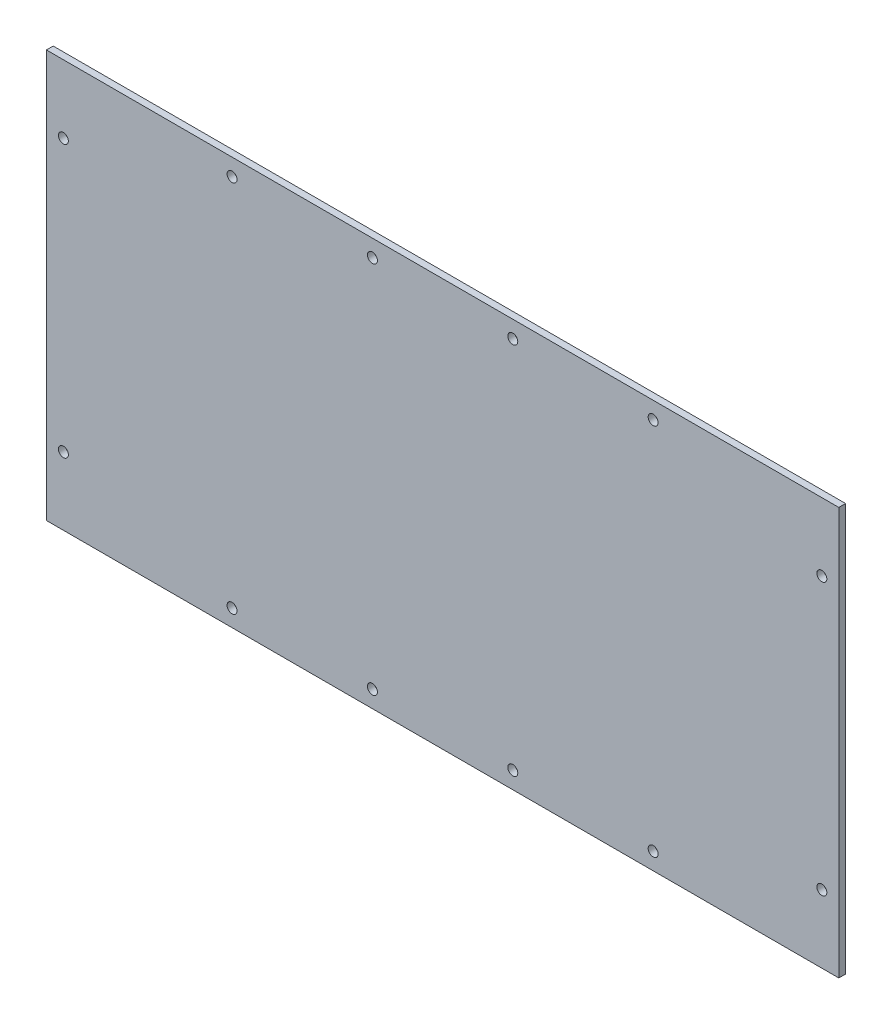
ISO-10303-21;
HEADER;
FILE_DESCRIPTION(('STEP AP214'),'2;1');
FILE_NAME('part.step','',(''),(''),'','','');
FILE_SCHEMA(('AUTOMOTIVE_DESIGN { 1 0 10303 214 1 1 1 1 }'));
ENDSEC;
DATA;
#1=APPLICATION_CONTEXT('core data for automotive mechanical design processes');
#2=APPLICATION_PROTOCOL_DEFINITION('international standard','automotive_design',2000,#1);
#3=PRODUCT_CONTEXT('',#1,'mechanical');
#4=PRODUCT('Part','Part','',(#3));
#5=PRODUCT_RELATED_PRODUCT_CATEGORY('part','',(#4));
#6=PRODUCT_DEFINITION_FORMATION('','',#4);
#7=PRODUCT_DEFINITION_CONTEXT('part definition',#1,'design');
#8=PRODUCT_DEFINITION('design','',#6,#7);
#9=PRODUCT_DEFINITION_SHAPE('','',#8);
#10=(LENGTH_UNIT() NAMED_UNIT(*) SI_UNIT(.MILLI.,.METRE.));
#11=(NAMED_UNIT(*) PLANE_ANGLE_UNIT() SI_UNIT($,.RADIAN.));
#12=(NAMED_UNIT(*) SI_UNIT($,.STERADIAN.) SOLID_ANGLE_UNIT());
#13=UNCERTAINTY_MEASURE_WITH_UNIT(LENGTH_MEASURE(1.E-05),#10,'distance_accuracy_value','');
#14=(GEOMETRIC_REPRESENTATION_CONTEXT(3) GLOBAL_UNCERTAINTY_ASSIGNED_CONTEXT((#13)) GLOBAL_UNIT_ASSIGNED_CONTEXT((#10,
#11,#12)) REPRESENTATION_CONTEXT('',''));
#15=CARTESIAN_POINT('',(0.,0.,0.));
#16=DIRECTION('',(0.,0.,1.));
#17=DIRECTION('',(1.,0.,0.));
#18=AXIS2_PLACEMENT_3D('',#15,#16,#17);
#19=CARTESIAN_POINT('',(175.,90.,3.));
#20=DIRECTION('',(-1.,0.,0.));
#21=DIRECTION('',(0.,0.,1.));
#22=AXIS2_PLACEMENT_3D('',#19,#20,#21);
#23=PLANE('',#22);
#24=DIRECTION('',(0.,1.,0.));
#25=VECTOR('',#24,1.);
#26=CARTESIAN_POINT('',(175.,90.,0.));
#27=LINE('',#26,#25);
#28=CARTESIAN_POINT('',(175.,-90.,0.));
#29=VERTEX_POINT('',#28);
#30=CARTESIAN_POINT('',(175.,90.,0.));
#31=VERTEX_POINT('',#30);
#32=EDGE_CURVE('E99',#29,#31,#27,.T.);
#33=ORIENTED_EDGE('',*,*,#32,.T.);
#34=DIRECTION('',(0.,0.,-1.));
#35=VECTOR('',#34,1.);
#36=CARTESIAN_POINT('',(175.,90.,3.));
#37=LINE('',#36,#35);
#38=CARTESIAN_POINT('',(175.,90.,3.));
#39=VERTEX_POINT('',#38);
#40=EDGE_CURVE('E11',#39,#31,#37,.T.);
#41=ORIENTED_EDGE('',*,*,#40,.F.);
#42=DIRECTION('',(0.,1.,0.));
#43=VECTOR('',#42,1.);
#44=CARTESIAN_POINT('',(175.,90.,3.));
#45=LINE('',#44,#43);
#46=CARTESIAN_POINT('',(175.,-90.,3.));
#47=VERTEX_POINT('',#46);
#48=EDGE_CURVE('E86',#47,#39,#45,.T.);
#49=ORIENTED_EDGE('',*,*,#48,.F.);
#50=DIRECTION('',(0.,0.,-1.));
#51=VECTOR('',#50,1.);
#52=CARTESIAN_POINT('',(175.,-90.,3.));
#53=LINE('',#52,#51);
#54=EDGE_CURVE('E95',#47,#29,#53,.T.);
#55=ORIENTED_EDGE('',*,*,#54,.T.);
#56=EDGE_LOOP('',(#33,#41,#49,#55));
#57=FACE_BOUND('',#56,.T.);
#58=ADVANCED_FACE('F33',(#57),#23,.F.);
#59=CARTESIAN_POINT('',(-175.,90.,3.));
#60=DIRECTION('',(0.,-1.,0.));
#61=DIRECTION('',(0.,0.,-1.));
#62=AXIS2_PLACEMENT_3D('',#59,#60,#61);
#63=PLANE('',#62);
#64=DIRECTION('',(-1.,0.,0.));
#65=VECTOR('',#64,1.);
#66=CARTESIAN_POINT('',(-175.,90.,0.));
#67=LINE('',#66,#65);
#68=CARTESIAN_POINT('',(-175.,90.,0.));
#69=VERTEX_POINT('',#68);
#70=EDGE_CURVE('E90',#31,#69,#67,.T.);
#71=ORIENTED_EDGE('',*,*,#70,.T.);
#72=DIRECTION('',(0.,0.,-1.));
#73=VECTOR('',#72,1.);
#74=CARTESIAN_POINT('',(-175.,90.,3.));
#75=LINE('',#74,#73);
#76=CARTESIAN_POINT('',(-175.,90.,3.));
#77=VERTEX_POINT('',#76);
#78=EDGE_CURVE('E42',#77,#69,#75,.T.);
#79=ORIENTED_EDGE('',*,*,#78,.F.);
#80=DIRECTION('',(-1.,0.,0.));
#81=VECTOR('',#80,1.);
#82=CARTESIAN_POINT('',(-175.,90.,3.));
#83=LINE('',#82,#81);
#84=EDGE_CURVE('E81',#39,#77,#83,.T.);
#85=ORIENTED_EDGE('',*,*,#84,.F.);
#86=ORIENTED_EDGE('',*,*,#40,.T.);
#87=EDGE_LOOP('',(#71,#79,#85,#86));
#88=FACE_BOUND('',#87,.T.);
#89=ADVANCED_FACE('F89',(#88),#63,.F.);
#90=CARTESIAN_POINT('',(-175.,90.,3.));
#91=DIRECTION('',(1.,0.,0.));
#92=DIRECTION('',(0.,0.,-1.));
#93=AXIS2_PLACEMENT_3D('',#90,#91,#92);
#94=PLANE('',#93);
#95=DIRECTION('',(0.,-1.,0.));
#96=VECTOR('',#95,1.);
#97=CARTESIAN_POINT('',(-175.,90.,0.));
#98=LINE('',#97,#96);
#99=CARTESIAN_POINT('',(-175.,-90.,0.));
#100=VERTEX_POINT('',#99);
#101=EDGE_CURVE('E68',#69,#100,#98,.T.);
#102=ORIENTED_EDGE('',*,*,#101,.T.);
#103=DIRECTION('',(0.,0.,-1.));
#104=VECTOR('',#103,1.);
#105=CARTESIAN_POINT('',(-175.,-90.,3.));
#106=LINE('',#105,#104);
#107=CARTESIAN_POINT('',(-175.,-90.,3.));
#108=VERTEX_POINT('',#107);
#109=EDGE_CURVE('E91',#108,#100,#106,.T.);
#110=ORIENTED_EDGE('',*,*,#109,.F.);
#111=DIRECTION('',(0.,-1.,0.));
#112=VECTOR('',#111,1.);
#113=CARTESIAN_POINT('',(-175.,90.,3.));
#114=LINE('',#113,#112);
#115=EDGE_CURVE('E84',#77,#108,#114,.T.);
#116=ORIENTED_EDGE('',*,*,#115,.F.);
#117=ORIENTED_EDGE('',*,*,#78,.T.);
#118=EDGE_LOOP('',(#102,#110,#116,#117));
#119=FACE_BOUND('',#118,.T.);
#120=ADVANCED_FACE('F93',(#119),#94,.F.);
#121=CARTESIAN_POINT('',(-175.,-90.,3.));
#122=DIRECTION('',(0.,1.,0.));
#123=DIRECTION('',(0.,0.,1.));
#124=AXIS2_PLACEMENT_3D('',#121,#122,#123);
#125=PLANE('',#124);
#126=DIRECTION('',(1.,0.,0.));
#127=VECTOR('',#126,1.);
#128=CARTESIAN_POINT('',(-175.,-90.,0.));
#129=LINE('',#128,#127);
#130=EDGE_CURVE('E74',#100,#29,#129,.T.);
#131=ORIENTED_EDGE('',*,*,#130,.T.);
#132=ORIENTED_EDGE('',*,*,#54,.F.);
#133=DIRECTION('',(1.,0.,0.));
#134=VECTOR('',#133,1.);
#135=CARTESIAN_POINT('',(-175.,-90.,3.));
#136=LINE('',#135,#134);
#137=EDGE_CURVE('E51',#108,#47,#136,.T.);
#138=ORIENTED_EDGE('',*,*,#137,.F.);
#139=ORIENTED_EDGE('',*,*,#109,.T.);
#140=EDGE_LOOP('',(#131,#132,#138,#139));
#141=FACE_BOUND('',#140,.T.);
#142=ADVANCED_FACE('F174',(#141),#125,.F.);
#143=CARTESIAN_POINT('',(0.,0.,3.));
#144=DIRECTION('',(0.,0.,1.));
#145=DIRECTION('',(1.,0.,0.));
#146=AXIS2_PLACEMENT_3D('',#143,#144,#145);
#147=PLANE('',#146);
#148=CARTESIAN_POINT('',(93.,-82.5,3.));
#149=DIRECTION('',(0.,0.,1.));
#150=DIRECTION('',(1.,0.,0.));
#151=AXIS2_PLACEMENT_3D('',#148,#149,#150);
#152=CIRCLE('',#151,2.2);
#153=CARTESIAN_POINT('',(95.2,-82.5,3.));
#154=VERTEX_POINT('',#153);
#155=EDGE_CURVE('E138',#154,#154,#152,.T.);
#156=ORIENTED_EDGE('',*,*,#155,.F.);
#157=EDGE_LOOP('',(#156));
#158=FACE_BOUND('',#157,.T.);
#159=CARTESIAN_POINT('',(31.,-82.5,3.));
#160=DIRECTION('',(0.,0.,1.));
#161=DIRECTION('',(1.,0.,0.));
#162=AXIS2_PLACEMENT_3D('',#159,#160,#161);
#163=CIRCLE('',#162,2.2);
#164=CARTESIAN_POINT('',(33.2,-82.5,3.));
#165=VERTEX_POINT('',#164);
#166=EDGE_CURVE('E333',#165,#165,#163,.T.);
#167=ORIENTED_EDGE('',*,*,#166,.F.);
#168=EDGE_LOOP('',(#167));
#169=FACE_BOUND('',#168,.T.);
#170=CARTESIAN_POINT('',(-31.,-82.5000000000001,3.));
#171=DIRECTION('',(0.,0.,1.));
#172=DIRECTION('',(1.,0.,0.));
#173=AXIS2_PLACEMENT_3D('',#170,#171,#172);
#174=CIRCLE('',#173,2.2);
#175=CARTESIAN_POINT('',(-28.8,-82.5000000000001,3.));
#176=VERTEX_POINT('',#175);
#177=EDGE_CURVE('E336',#176,#176,#174,.T.);
#178=ORIENTED_EDGE('',*,*,#177,.F.);
#179=EDGE_LOOP('',(#178));
#180=FACE_BOUND('',#179,.T.);
#181=CARTESIAN_POINT('',(-93.,-82.5000000000001,3.));
#182=DIRECTION('',(0.,0.,1.));
#183=DIRECTION('',(1.,0.,0.));
#184=AXIS2_PLACEMENT_3D('',#181,#182,#183);
#185=CIRCLE('',#184,2.2);
#186=CARTESIAN_POINT('',(-90.8,-82.5000000000001,3.));
#187=VERTEX_POINT('',#186);
#188=EDGE_CURVE('E341',#187,#187,#185,.T.);
#189=ORIENTED_EDGE('',*,*,#188,.F.);
#190=EDGE_LOOP('',(#189));
#191=FACE_BOUND('',#190,.T.);
#192=CARTESIAN_POINT('',(93.,82.5,3.));
#193=DIRECTION('',(0.,0.,1.));
#194=DIRECTION('',(1.,0.,0.));
#195=AXIS2_PLACEMENT_3D('',#192,#193,#194);
#196=CIRCLE('',#195,2.2);
#197=CARTESIAN_POINT('',(95.2,82.5,3.));
#198=VERTEX_POINT('',#197);
#199=EDGE_CURVE('E124',#198,#198,#196,.T.);
#200=ORIENTED_EDGE('',*,*,#199,.F.);
#201=EDGE_LOOP('',(#200));
#202=FACE_BOUND('',#201,.T.);
#203=CARTESIAN_POINT('',(31.,82.5,3.));
#204=DIRECTION('',(0.,0.,1.));
#205=DIRECTION('',(1.,0.,0.));
#206=AXIS2_PLACEMENT_3D('',#203,#204,#205);
#207=CIRCLE('',#206,2.2);
#208=CARTESIAN_POINT('',(33.2,82.5,3.));
#209=VERTEX_POINT('',#208);
#210=EDGE_CURVE('E154',#209,#209,#207,.T.);
#211=ORIENTED_EDGE('',*,*,#210,.F.);
#212=EDGE_LOOP('',(#211));
#213=FACE_BOUND('',#212,.T.);
#214=CARTESIAN_POINT('',(-31.,82.5,3.));
#215=DIRECTION('',(0.,0.,1.));
#216=DIRECTION('',(1.,0.,0.));
#217=AXIS2_PLACEMENT_3D('',#214,#215,#216);
#218=CIRCLE('',#217,2.2);
#219=CARTESIAN_POINT('',(-28.8,82.5,3.));
#220=VERTEX_POINT('',#219);
#221=EDGE_CURVE('E149',#220,#220,#218,.T.);
#222=ORIENTED_EDGE('',*,*,#221,.F.);
#223=EDGE_LOOP('',(#222));
#224=FACE_BOUND('',#223,.T.);
#225=CARTESIAN_POINT('',(-93.,82.4999999999999,3.));
#226=DIRECTION('',(0.,0.,1.));
#227=DIRECTION('',(1.,0.,0.));
#228=AXIS2_PLACEMENT_3D('',#225,#226,#227);
#229=CIRCLE('',#228,2.2);
#230=CARTESIAN_POINT('',(-90.8,82.4999999999999,3.));
#231=VERTEX_POINT('',#230);
#232=EDGE_CURVE('E145',#231,#231,#229,.T.);
#233=ORIENTED_EDGE('',*,*,#232,.F.);
#234=EDGE_LOOP('',(#233));
#235=FACE_BOUND('',#234,.T.);
#236=CARTESIAN_POINT('',(167.5,-60.,3.));
#237=DIRECTION('',(0.,0.,1.));
#238=DIRECTION('',(1.,0.,0.));
#239=AXIS2_PLACEMENT_3D('',#236,#237,#238);
#240=CIRCLE('',#239,2.20000000000001);
#241=CARTESIAN_POINT('',(169.7,-60.,3.));
#242=VERTEX_POINT('',#241);
#243=EDGE_CURVE('E161',#242,#242,#240,.T.);
#244=ORIENTED_EDGE('',*,*,#243,.F.);
#245=EDGE_LOOP('',(#244));
#246=FACE_BOUND('',#245,.T.);
#247=CARTESIAN_POINT('',(-167.5,60.,3.));
#248=DIRECTION('',(0.,0.,1.));
#249=DIRECTION('',(1.,0.,0.));
#250=AXIS2_PLACEMENT_3D('',#247,#248,#249);
#251=CIRCLE('',#250,2.20000000000001);
#252=CARTESIAN_POINT('',(-165.3,60.,3.));
#253=VERTEX_POINT('',#252);
#254=EDGE_CURVE('E160',#253,#253,#251,.T.);
#255=ORIENTED_EDGE('',*,*,#254,.F.);
#256=EDGE_LOOP('',(#255));
#257=FACE_BOUND('',#256,.T.);
#258=CARTESIAN_POINT('',(-167.5,-60.,3.));
#259=DIRECTION('',(0.,0.,1.));
#260=DIRECTION('',(1.,0.,0.));
#261=AXIS2_PLACEMENT_3D('',#258,#259,#260);
#262=CIRCLE('',#261,2.20000000000001);
#263=CARTESIAN_POINT('',(-165.3,-60.,3.));
#264=VERTEX_POINT('',#263);
#265=EDGE_CURVE('E133',#264,#264,#262,.T.);
#266=ORIENTED_EDGE('',*,*,#265,.F.);
#267=EDGE_LOOP('',(#266));
#268=FACE_BOUND('',#267,.T.);
#269=CARTESIAN_POINT('',(167.5,60.,3.));
#270=DIRECTION('',(0.,0.,1.));
#271=DIRECTION('',(1.,0.,0.));
#272=AXIS2_PLACEMENT_3D('',#269,#270,#271);
#273=CIRCLE('',#272,2.20000000000001);
#274=CARTESIAN_POINT('',(169.7,60.,3.));
#275=VERTEX_POINT('',#274);
#276=EDGE_CURVE('E112',#275,#275,#273,.T.);
#277=ORIENTED_EDGE('',*,*,#276,.F.);
#278=EDGE_LOOP('',(#277));
#279=FACE_BOUND('',#278,.T.);
#280=ORIENTED_EDGE('',*,*,#48,.T.);
#281=ORIENTED_EDGE('',*,*,#84,.T.);
#282=ORIENTED_EDGE('',*,*,#115,.T.);
#283=ORIENTED_EDGE('',*,*,#137,.T.);
#284=EDGE_LOOP('',(#280,#281,#282,#283));
#285=FACE_BOUND('',#284,.T.);
#286=ADVANCED_FACE('F82',(#158,#169,#180,#191,#202,#213,#224,#235,#246,#257,#268,#279,#285),
#147,.T.);
#287=CARTESIAN_POINT('',(0.,0.,0.));
#288=DIRECTION('',(0.,0.,1.));
#289=DIRECTION('',(1.,0.,0.));
#290=AXIS2_PLACEMENT_3D('',#287,#288,#289);
#291=PLANE('',#290);
#292=CARTESIAN_POINT('',(93.,-82.5,0.));
#293=DIRECTION('',(0.,0.,1.));
#294=DIRECTION('',(1.,0.,0.));
#295=AXIS2_PLACEMENT_3D('',#292,#293,#294);
#296=CIRCLE('',#295,2.2);
#297=CARTESIAN_POINT('',(95.2,-82.5,0.));
#298=VERTEX_POINT('',#297);
#299=EDGE_CURVE('E36',#298,#298,#296,.T.);
#300=ORIENTED_EDGE('',*,*,#299,.T.);
#301=EDGE_LOOP('',(#300));
#302=FACE_BOUND('',#301,.T.);
#303=CARTESIAN_POINT('',(31.,-82.5,0.));
#304=DIRECTION('',(0.,0.,1.));
#305=DIRECTION('',(1.,0.,0.));
#306=AXIS2_PLACEMENT_3D('',#303,#304,#305);
#307=CIRCLE('',#306,2.2);
#308=CARTESIAN_POINT('',(33.2,-82.5,0.));
#309=VERTEX_POINT('',#308);
#310=EDGE_CURVE('E140',#309,#309,#307,.T.);
#311=ORIENTED_EDGE('',*,*,#310,.T.);
#312=EDGE_LOOP('',(#311));
#313=FACE_BOUND('',#312,.T.);
#314=CARTESIAN_POINT('',(-31.,-82.5000000000001,0.));
#315=DIRECTION('',(0.,0.,1.));
#316=DIRECTION('',(1.,0.,0.));
#317=AXIS2_PLACEMENT_3D('',#314,#315,#316);
#318=CIRCLE('',#317,2.2);
#319=CARTESIAN_POINT('',(-28.8,-82.5000000000001,0.));
#320=VERTEX_POINT('',#319);
#321=EDGE_CURVE('E137',#320,#320,#318,.T.);
#322=ORIENTED_EDGE('',*,*,#321,.T.);
#323=EDGE_LOOP('',(#322));
#324=FACE_BOUND('',#323,.T.);
#325=CARTESIAN_POINT('',(-93.,-82.5000000000001,0.));
#326=DIRECTION('',(0.,0.,1.));
#327=DIRECTION('',(1.,0.,0.));
#328=AXIS2_PLACEMENT_3D('',#325,#326,#327);
#329=CIRCLE('',#328,2.2);
#330=CARTESIAN_POINT('',(-90.8,-82.5000000000001,0.));
#331=VERTEX_POINT('',#330);
#332=EDGE_CURVE('E134',#331,#331,#329,.T.);
#333=ORIENTED_EDGE('',*,*,#332,.T.);
#334=EDGE_LOOP('',(#333));
#335=FACE_BOUND('',#334,.T.);
#336=CARTESIAN_POINT('',(93.,82.5,0.));
#337=DIRECTION('',(0.,0.,1.));
#338=DIRECTION('',(1.,0.,0.));
#339=AXIS2_PLACEMENT_3D('',#336,#337,#338);
#340=CIRCLE('',#339,2.2);
#341=CARTESIAN_POINT('',(95.2,82.5,0.));
#342=VERTEX_POINT('',#341);
#343=EDGE_CURVE('E130',#342,#342,#340,.T.);
#344=ORIENTED_EDGE('',*,*,#343,.T.);
#345=EDGE_LOOP('',(#344));
#346=FACE_BOUND('',#345,.T.);
#347=CARTESIAN_POINT('',(31.,82.5,0.));
#348=DIRECTION('',(0.,0.,1.));
#349=DIRECTION('',(1.,0.,0.));
#350=AXIS2_PLACEMENT_3D('',#347,#348,#349);
#351=CIRCLE('',#350,2.2);
#352=CARTESIAN_POINT('',(33.2,82.5,0.));
#353=VERTEX_POINT('',#352);
#354=EDGE_CURVE('E127',#353,#353,#351,.T.);
#355=ORIENTED_EDGE('',*,*,#354,.T.);
#356=EDGE_LOOP('',(#355));
#357=FACE_BOUND('',#356,.T.);
#358=CARTESIAN_POINT('',(-31.,82.5,0.));
#359=DIRECTION('',(0.,0.,1.));
#360=DIRECTION('',(1.,0.,0.));
#361=AXIS2_PLACEMENT_3D('',#358,#359,#360);
#362=CIRCLE('',#361,2.2);
#363=CARTESIAN_POINT('',(-28.8,82.5,0.));
#364=VERTEX_POINT('',#363);
#365=EDGE_CURVE('E123',#364,#364,#362,.T.);
#366=ORIENTED_EDGE('',*,*,#365,.T.);
#367=EDGE_LOOP('',(#366));
#368=FACE_BOUND('',#367,.T.);
#369=CARTESIAN_POINT('',(-93.,82.4999999999999,0.));
#370=DIRECTION('',(0.,0.,1.));
#371=DIRECTION('',(1.,0.,0.));
#372=AXIS2_PLACEMENT_3D('',#369,#370,#371);
#373=CIRCLE('',#372,2.2);
#374=CARTESIAN_POINT('',(-90.8,82.4999999999999,0.));
#375=VERTEX_POINT('',#374);
#376=EDGE_CURVE('E120',#375,#375,#373,.T.);
#377=ORIENTED_EDGE('',*,*,#376,.T.);
#378=EDGE_LOOP('',(#377));
#379=FACE_BOUND('',#378,.T.);
#380=CARTESIAN_POINT('',(167.5,-60.,0.));
#381=DIRECTION('',(0.,0.,1.));
#382=DIRECTION('',(1.,0.,0.));
#383=AXIS2_PLACEMENT_3D('',#380,#381,#382);
#384=CIRCLE('',#383,2.20000000000001);
#385=CARTESIAN_POINT('',(169.7,-60.,0.));
#386=VERTEX_POINT('',#385);
#387=EDGE_CURVE('E102',#386,#386,#384,.T.);
#388=ORIENTED_EDGE('',*,*,#387,.T.);
#389=EDGE_LOOP('',(#388));
#390=FACE_BOUND('',#389,.T.);
#391=CARTESIAN_POINT('',(-167.5,60.,0.));
#392=DIRECTION('',(0.,0.,1.));
#393=DIRECTION('',(1.,0.,0.));
#394=AXIS2_PLACEMENT_3D('',#391,#392,#393);
#395=CIRCLE('',#394,2.20000000000001);
#396=CARTESIAN_POINT('',(-165.3,60.,0.));
#397=VERTEX_POINT('',#396);
#398=EDGE_CURVE('E115',#397,#397,#395,.T.);
#399=ORIENTED_EDGE('',*,*,#398,.T.);
#400=EDGE_LOOP('',(#399));
#401=FACE_BOUND('',#400,.T.);
#402=CARTESIAN_POINT('',(-167.5,-60.,0.));
#403=DIRECTION('',(0.,0.,1.));
#404=DIRECTION('',(1.,0.,0.));
#405=AXIS2_PLACEMENT_3D('',#402,#403,#404);
#406=CIRCLE('',#405,2.20000000000001);
#407=CARTESIAN_POINT('',(-165.3,-60.,0.));
#408=VERTEX_POINT('',#407);
#409=EDGE_CURVE('E111',#408,#408,#406,.T.);
#410=ORIENTED_EDGE('',*,*,#409,.T.);
#411=EDGE_LOOP('',(#410));
#412=FACE_BOUND('',#411,.T.);
#413=CARTESIAN_POINT('',(167.5,60.,0.));
#414=DIRECTION('',(0.,0.,1.));
#415=DIRECTION('',(1.,0.,0.));
#416=AXIS2_PLACEMENT_3D('',#413,#414,#415);
#417=CIRCLE('',#416,2.20000000000001);
#418=CARTESIAN_POINT('',(169.7,60.,0.));
#419=VERTEX_POINT('',#418);
#420=EDGE_CURVE('E108',#419,#419,#417,.T.);
#421=ORIENTED_EDGE('',*,*,#420,.T.);
#422=EDGE_LOOP('',(#421));
#423=FACE_BOUND('',#422,.T.);
#424=ORIENTED_EDGE('',*,*,#32,.F.);
#425=ORIENTED_EDGE('',*,*,#130,.F.);
#426=ORIENTED_EDGE('',*,*,#101,.F.);
#427=ORIENTED_EDGE('',*,*,#70,.F.);
#428=EDGE_LOOP('',(#424,#425,#426,#427));
#429=FACE_BOUND('',#428,.T.);
#430=ADVANCED_FACE('F173',(#302,#313,#324,#335,#346,#357,#368,#379,#390,#401,#412,#423,#429),
#291,.F.);
#431=CARTESIAN_POINT('',(167.5,60.,-137.));
#432=DIRECTION('',(0.,0.,1.));
#433=DIRECTION('',(1.,0.,0.));
#434=AXIS2_PLACEMENT_3D('',#431,#432,#433);
#435=CYLINDRICAL_SURFACE('',#434,2.20000000000001);
#436=ORIENTED_EDGE('',*,*,#276,.T.);
#437=EDGE_LOOP('',(#436));
#438=FACE_BOUND('',#437,.T.);
#439=ORIENTED_EDGE('',*,*,#420,.F.);
#440=EDGE_LOOP('',(#439));
#441=FACE_BOUND('',#440,.T.);
#442=ADVANCED_FACE('F169',(#438,#441),#435,.F.);
#443=CARTESIAN_POINT('',(-167.5,-60.,-137.));
#444=DIRECTION('',(0.,0.,1.));
#445=DIRECTION('',(1.,0.,0.));
#446=AXIS2_PLACEMENT_3D('',#443,#444,#445);
#447=CYLINDRICAL_SURFACE('',#446,2.20000000000001);
#448=ORIENTED_EDGE('',*,*,#265,.T.);
#449=EDGE_LOOP('',(#448));
#450=FACE_BOUND('',#449,.T.);
#451=ORIENTED_EDGE('',*,*,#409,.F.);
#452=EDGE_LOOP('',(#451));
#453=FACE_BOUND('',#452,.T.);
#454=ADVANCED_FACE('F222',(#450,#453),#447,.F.);
#455=CARTESIAN_POINT('',(-167.5,60.,-137.));
#456=DIRECTION('',(0.,0.,1.));
#457=DIRECTION('',(1.,0.,0.));
#458=AXIS2_PLACEMENT_3D('',#455,#456,#457);
#459=CYLINDRICAL_SURFACE('',#458,2.20000000000001);
#460=ORIENTED_EDGE('',*,*,#254,.T.);
#461=EDGE_LOOP('',(#460));
#462=FACE_BOUND('',#461,.T.);
#463=ORIENTED_EDGE('',*,*,#398,.F.);
#464=EDGE_LOOP('',(#463));
#465=FACE_BOUND('',#464,.T.);
#466=ADVANCED_FACE('F227',(#462,#465),#459,.F.);
#467=CARTESIAN_POINT('',(167.5,-60.,-137.));
#468=DIRECTION('',(0.,0.,1.));
#469=DIRECTION('',(1.,0.,0.));
#470=AXIS2_PLACEMENT_3D('',#467,#468,#469);
#471=CYLINDRICAL_SURFACE('',#470,2.20000000000001);
#472=ORIENTED_EDGE('',*,*,#243,.T.);
#473=EDGE_LOOP('',(#472));
#474=FACE_BOUND('',#473,.T.);
#475=ORIENTED_EDGE('',*,*,#387,.F.);
#476=EDGE_LOOP('',(#475));
#477=FACE_BOUND('',#476,.T.);
#478=ADVANCED_FACE('F235',(#474,#477),#471,.F.);
#479=CARTESIAN_POINT('',(-93.,82.4999999999999,-307.));
#480=DIRECTION('',(0.,0.,1.));
#481=DIRECTION('',(1.,0.,0.));
#482=AXIS2_PLACEMENT_3D('',#479,#480,#481);
#483=CYLINDRICAL_SURFACE('',#482,2.2);
#484=ORIENTED_EDGE('',*,*,#232,.T.);
#485=EDGE_LOOP('',(#484));
#486=FACE_BOUND('',#485,.T.);
#487=ORIENTED_EDGE('',*,*,#376,.F.);
#488=EDGE_LOOP('',(#487));
#489=FACE_BOUND('',#488,.T.);
#490=ADVANCED_FACE('F243',(#486,#489),#483,.F.);
#491=CARTESIAN_POINT('',(-31.,82.5,-307.));
#492=DIRECTION('',(0.,0.,1.));
#493=DIRECTION('',(1.,0.,0.));
#494=AXIS2_PLACEMENT_3D('',#491,#492,#493);
#495=CYLINDRICAL_SURFACE('',#494,2.2);
#496=ORIENTED_EDGE('',*,*,#221,.T.);
#497=EDGE_LOOP('',(#496));
#498=FACE_BOUND('',#497,.T.);
#499=ORIENTED_EDGE('',*,*,#365,.F.);
#500=EDGE_LOOP('',(#499));
#501=FACE_BOUND('',#500,.T.);
#502=ADVANCED_FACE('F251',(#498,#501),#495,.F.);
#503=CARTESIAN_POINT('',(31.,82.5,-307.));
#504=DIRECTION('',(0.,0.,1.));
#505=DIRECTION('',(1.,0.,0.));
#506=AXIS2_PLACEMENT_3D('',#503,#504,#505);
#507=CYLINDRICAL_SURFACE('',#506,2.2);
#508=ORIENTED_EDGE('',*,*,#210,.T.);
#509=EDGE_LOOP('',(#508));
#510=FACE_BOUND('',#509,.T.);
#511=ORIENTED_EDGE('',*,*,#354,.F.);
#512=EDGE_LOOP('',(#511));
#513=FACE_BOUND('',#512,.T.);
#514=ADVANCED_FACE('F258',(#510,#513),#507,.F.);
#515=CARTESIAN_POINT('',(93.,82.5,-307.));
#516=DIRECTION('',(0.,0.,1.));
#517=DIRECTION('',(1.,0.,0.));
#518=AXIS2_PLACEMENT_3D('',#515,#516,#517);
#519=CYLINDRICAL_SURFACE('',#518,2.2);
#520=ORIENTED_EDGE('',*,*,#199,.T.);
#521=EDGE_LOOP('',(#520));
#522=FACE_BOUND('',#521,.T.);
#523=ORIENTED_EDGE('',*,*,#343,.F.);
#524=EDGE_LOOP('',(#523));
#525=FACE_BOUND('',#524,.T.);
#526=ADVANCED_FACE('F266',(#522,#525),#519,.F.);
#527=CARTESIAN_POINT('',(-93.,-82.5000000000001,-307.));
#528=DIRECTION('',(0.,0.,1.));
#529=DIRECTION('',(1.,0.,0.));
#530=AXIS2_PLACEMENT_3D('',#527,#528,#529);
#531=CYLINDRICAL_SURFACE('',#530,2.2);
#532=ORIENTED_EDGE('',*,*,#188,.T.);
#533=EDGE_LOOP('',(#532));
#534=FACE_BOUND('',#533,.T.);
#535=ORIENTED_EDGE('',*,*,#332,.F.);
#536=EDGE_LOOP('',(#535));
#537=FACE_BOUND('',#536,.T.);
#538=ADVANCED_FACE('F273',(#534,#537),#531,.F.);
#539=CARTESIAN_POINT('',(-31.,-82.5000000000001,-307.));
#540=DIRECTION('',(0.,0.,1.));
#541=DIRECTION('',(1.,0.,0.));
#542=AXIS2_PLACEMENT_3D('',#539,#540,#541);
#543=CYLINDRICAL_SURFACE('',#542,2.2);
#544=ORIENTED_EDGE('',*,*,#177,.T.);
#545=EDGE_LOOP('',(#544));
#546=FACE_BOUND('',#545,.T.);
#547=ORIENTED_EDGE('',*,*,#321,.F.);
#548=EDGE_LOOP('',(#547));
#549=FACE_BOUND('',#548,.T.);
#550=ADVANCED_FACE('F280',(#546,#549),#543,.F.);
#551=CARTESIAN_POINT('',(31.,-82.5,-307.));
#552=DIRECTION('',(0.,0.,1.));
#553=DIRECTION('',(1.,0.,0.));
#554=AXIS2_PLACEMENT_3D('',#551,#552,#553);
#555=CYLINDRICAL_SURFACE('',#554,2.2);
#556=ORIENTED_EDGE('',*,*,#166,.T.);
#557=EDGE_LOOP('',(#556));
#558=FACE_BOUND('',#557,.T.);
#559=ORIENTED_EDGE('',*,*,#310,.F.);
#560=EDGE_LOOP('',(#559));
#561=FACE_BOUND('',#560,.T.);
#562=ADVANCED_FACE('F288',(#558,#561),#555,.F.);
#563=CARTESIAN_POINT('',(93.,-82.5,-307.));
#564=DIRECTION('',(0.,0.,1.));
#565=DIRECTION('',(1.,0.,0.));
#566=AXIS2_PLACEMENT_3D('',#563,#564,#565);
#567=CYLINDRICAL_SURFACE('',#566,2.2);
#568=ORIENTED_EDGE('',*,*,#155,.T.);
#569=EDGE_LOOP('',(#568));
#570=FACE_BOUND('',#569,.T.);
#571=ORIENTED_EDGE('',*,*,#299,.F.);
#572=EDGE_LOOP('',(#571));
#573=FACE_BOUND('',#572,.T.);
#574=ADVANCED_FACE('F296',(#570,#573),#567,.F.);
#575=CLOSED_SHELL('',(#58,#89,#120,#142,#286,#430,#442,#454,#466,#478,#490,#502,#514,#526,#538,
#550,#562,#574));
#576=MANIFOLD_SOLID_BREP('B2',#575);
#577=ADVANCED_BREP_SHAPE_REPRESENTATION('',(#18,#576),#14);
#578=SHAPE_DEFINITION_REPRESENTATION(#9,#577);
ENDSEC;
END-ISO-10303-21;
